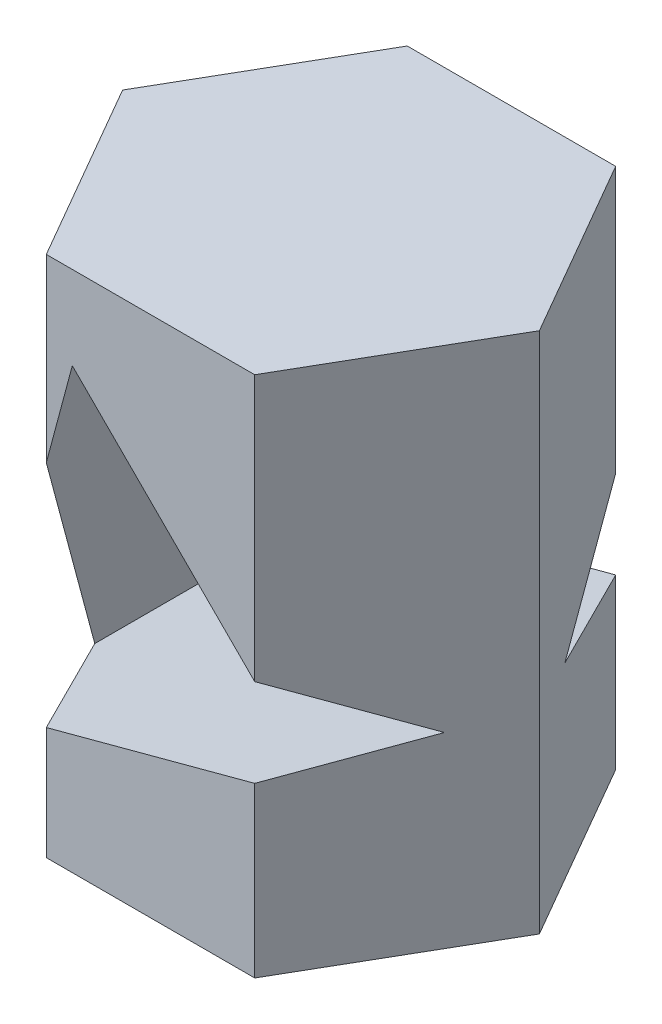
ISO-10303-21;
HEADER;
FILE_DESCRIPTION(('STEP AP214'),'2;1');
FILE_NAME('part.step','',(''),(''),'','','');
FILE_SCHEMA(('AUTOMOTIVE_DESIGN { 1 0 10303 214 1 1 1 1 }'));
ENDSEC;
DATA;
#1=APPLICATION_CONTEXT('core data for automotive mechanical design processes');
#2=APPLICATION_PROTOCOL_DEFINITION('international standard','automotive_design',2000,#1);
#3=PRODUCT_CONTEXT('',#1,'mechanical');
#4=PRODUCT('Part','Part','',(#3));
#5=PRODUCT_RELATED_PRODUCT_CATEGORY('part','',(#4));
#6=PRODUCT_DEFINITION_FORMATION('','',#4);
#7=PRODUCT_DEFINITION_CONTEXT('part definition',#1,'design');
#8=PRODUCT_DEFINITION('design','',#6,#7);
#9=PRODUCT_DEFINITION_SHAPE('','',#8);
#10=(LENGTH_UNIT() NAMED_UNIT(*) SI_UNIT(.MILLI.,.METRE.));
#11=(NAMED_UNIT(*) PLANE_ANGLE_UNIT() SI_UNIT($,.RADIAN.));
#12=(NAMED_UNIT(*) SI_UNIT($,.STERADIAN.) SOLID_ANGLE_UNIT());
#13=UNCERTAINTY_MEASURE_WITH_UNIT(LENGTH_MEASURE(1.E-05),#10,'distance_accuracy_value','');
#14=(GEOMETRIC_REPRESENTATION_CONTEXT(3) GLOBAL_UNCERTAINTY_ASSIGNED_CONTEXT((#13)) GLOBAL_UNIT_ASSIGNED_CONTEXT((#10,
#11,#12)) REPRESENTATION_CONTEXT('',''));
#15=CARTESIAN_POINT('',(0.,0.,0.));
#16=DIRECTION('',(0.,0.,1.));
#17=DIRECTION('',(1.,0.,0.));
#18=AXIS2_PLACEMENT_3D('',#15,#16,#17);
#19=CARTESIAN_POINT('',(21.9393102292057,110.,-38.));
#20=DIRECTION('',(0.,0.,1.));
#21=DIRECTION('',(1.,0.,0.));
#22=AXIS2_PLACEMENT_3D('',#19,#20,#21);
#23=PLANE('',#22);
#24=DIRECTION('',(0.,-1.,0.));
#25=VECTOR('',#24,1.);
#26=CARTESIAN_POINT('',(-21.9393102292058,110.,-38.));
#27=LINE('',#26,#25);
#28=CARTESIAN_POINT('',(-21.9393102292058,23.7350269189626,-38.));
#29=VERTEX_POINT('',#28);
#30=CARTESIAN_POINT('',(-21.9393102292058,0.,-38.));
#31=VERTEX_POINT('',#30);
#32=EDGE_CURVE('E222',#29,#31,#27,.T.);
#33=ORIENTED_EDGE('',*,*,#32,.F.);
#34=DIRECTION('',(0.965925826289068,0.258819045102521,0.));
#35=VECTOR('',#34,1.);
#36=CARTESIAN_POINT('',(-35.8786204584116,20.,-38.));
#37=LINE('',#36,#35);
#38=CARTESIAN_POINT('',(21.9393102292057,35.4922678357857,-38.));
#39=VERTEX_POINT('',#38);
#40=EDGE_CURVE('E146',#29,#39,#37,.T.);
#41=ORIENTED_EDGE('',*,*,#40,.T.);
#42=DIRECTION('',(0.,-1.,0.));
#43=VECTOR('',#42,1.);
#44=CARTESIAN_POINT('',(21.9393102292057,110.,-38.));
#45=LINE('',#44,#43);
#46=CARTESIAN_POINT('',(21.9393102292057,0.,-38.));
#47=VERTEX_POINT('',#46);
#48=EDGE_CURVE('E193',#39,#47,#45,.T.);
#49=ORIENTED_EDGE('',*,*,#48,.T.);
#50=DIRECTION('',(-1.,0.,0.));
#51=VECTOR('',#50,1.);
#52=CARTESIAN_POINT('',(21.9393102292057,0.,-38.));
#53=LINE('',#52,#51);
#54=EDGE_CURVE('E178',#47,#31,#53,.T.);
#55=ORIENTED_EDGE('',*,*,#54,.T.);
#56=EDGE_LOOP('',(#33,#41,#49,#55));
#57=FACE_BOUND('',#56,.T.);
#58=ADVANCED_FACE('F33',(#57),#23,.F.);
#59=CARTESIAN_POINT('',(-21.9393102292058,110.,38.));
#60=DIRECTION('',(0.,0.,-1.));
#61=DIRECTION('',(-1.,0.,0.));
#62=AXIS2_PLACEMENT_3D('',#59,#60,#61);
#63=PLANE('',#62);
#64=DIRECTION('',(0.,-1.,0.));
#65=VECTOR('',#64,1.);
#66=CARTESIAN_POINT('',(21.9393102292058,110.,38.));
#67=LINE('',#66,#65);
#68=CARTESIAN_POINT('',(21.9393102292058,35.4922678357857,38.));
#69=VERTEX_POINT('',#68);
#70=CARTESIAN_POINT('',(21.9393102292058,0.,38.));
#71=VERTEX_POINT('',#70);
#72=EDGE_CURVE('E214',#69,#71,#67,.T.);
#73=ORIENTED_EDGE('',*,*,#72,.F.);
#74=DIRECTION('',(0.965925826289068,0.258819045102521,0.));
#75=VECTOR('',#74,1.);
#76=CARTESIAN_POINT('',(-35.8786204584116,20.,38.));
#77=LINE('',#76,#75);
#78=CARTESIAN_POINT('',(-21.9393102292058,23.7350269189626,38.));
#79=VERTEX_POINT('',#78);
#80=EDGE_CURVE('E48',#79,#69,#77,.T.);
#81=ORIENTED_EDGE('',*,*,#80,.F.);
#82=DIRECTION('',(0.,-1.,0.));
#83=VECTOR('',#82,1.);
#84=CARTESIAN_POINT('',(-21.9393102292058,110.,38.));
#85=LINE('',#84,#83);
#86=CARTESIAN_POINT('',(-21.9393102292058,0.,38.));
#87=VERTEX_POINT('',#86);
#88=EDGE_CURVE('E217',#79,#87,#85,.T.);
#89=ORIENTED_EDGE('',*,*,#88,.T.);
#90=DIRECTION('',(1.,0.,0.));
#91=VECTOR('',#90,1.);
#92=CARTESIAN_POINT('',(-21.9393102292058,0.,38.));
#93=LINE('',#92,#91);
#94=EDGE_CURVE('E201',#87,#71,#93,.T.);
#95=ORIENTED_EDGE('',*,*,#94,.T.);
#96=EDGE_LOOP('',(#73,#81,#89,#95));
#97=FACE_BOUND('',#96,.T.);
#98=ADVANCED_FACE('F261',(#97),#63,.F.);
#99=CARTESIAN_POINT('',(21.9393102292057,110.,-38.));
#100=VERTEX_POINT('',#99);
#101=CARTESIAN_POINT('',(21.9393102292057,54.0379346667519,-38.));
#102=VERTEX_POINT('',#101);
#103=EDGE_CURVE('E208',#100,#102,#45,.T.);
#104=ORIENTED_EDGE('',*,*,#103,.T.);
#105=DIRECTION('',(-0.707106781186548,0.707106781186547,0.));
#106=VECTOR('',#105,1.);
#107=CARTESIAN_POINT('',(36.5658165132686,39.4114283826891,-38.));
#108=LINE('',#107,#106);
#109=CARTESIAN_POINT('',(-16.4671920757225,92.4444369716801,-38.));
#110=VERTEX_POINT('',#109);
#111=EDGE_CURVE('E154',#102,#110,#108,.T.);
#112=ORIENTED_EDGE('',*,*,#111,.T.);
#113=DIRECTION('',(-0.258819045102521,-0.965925826289068,0.));
#114=VECTOR('',#113,1.);
#115=CARTESIAN_POINT('',(-16.4671920757225,92.4444369716801,-38.));
#116=LINE('',#115,#114);
#117=CARTESIAN_POINT('',(-21.9393102292058,72.0222139978605,-38.));
#118=VERTEX_POINT('',#117);
#119=EDGE_CURVE('E143',#110,#118,#116,.T.);
#120=ORIENTED_EDGE('',*,*,#119,.T.);
#121=CARTESIAN_POINT('',(-21.9393102292058,110.,-38.));
#122=VERTEX_POINT('',#121);
#123=EDGE_CURVE('E223',#122,#118,#27,.T.);
#124=ORIENTED_EDGE('',*,*,#123,.F.);
#125=DIRECTION('',(-1.,0.,0.));
#126=VECTOR('',#125,1.);
#127=CARTESIAN_POINT('',(21.9393102292057,110.,-38.));
#128=LINE('',#127,#126);
#129=EDGE_CURVE('E179',#100,#122,#128,.T.);
#130=ORIENTED_EDGE('',*,*,#129,.F.);
#131=EDGE_LOOP('',(#104,#112,#120,#124,#130));
#132=FACE_BOUND('',#131,.T.);
#133=ADVANCED_FACE('F35',(#132),#23,.F.);
#134=CARTESIAN_POINT('',(-21.9393102292058,110.,-38.));
#135=DIRECTION('',(0.866025403784439,0.,0.5));
#136=DIRECTION('',(0.5,0.,-0.866025403784439));
#137=AXIS2_PLACEMENT_3D('',#134,#135,#136);
#138=PLANE('',#137);
#139=DIRECTION('',(-0.236173745241573,-0.881412416655379,0.409064926172233));
#140=VECTOR('',#139,1.);
#141=CARTESIAN_POINT('',(-14.0336085200901,101.526694445764,-51.6930770296725));
#142=LINE('',#141,#140);
#143=CARTESIAN_POINT('',(-35.8786204584116,20.,-13.856406460551));
#144=VERTEX_POINT('',#143);
#145=EDGE_CURVE('E175',#118,#144,#142,.T.);
#146=ORIENTED_EDGE('',*,*,#145,.T.);
#147=DIRECTION('',(0.495572219835078,0.132788176096108,-0.858356263574049));
#148=VECTOR('',#147,1.);
#149=CARTESIAN_POINT('',(-16.2625460930329,25.2561112848721,-47.8324439064363));
#150=LINE('',#149,#148);
#151=EDGE_CURVE('E169',#144,#29,#150,.T.);
#152=ORIENTED_EDGE('',*,*,#151,.T.);
#153=ORIENTED_EDGE('',*,*,#32,.T.);
#154=DIRECTION('',(-0.5,0.,0.866025403784439));
#155=VECTOR('',#154,1.);
#156=CARTESIAN_POINT('',(-21.9393102292058,0.,-38.));
#157=LINE('',#156,#155);
#158=CARTESIAN_POINT('',(-43.8786204584116,0.,0.));
#159=VERTEX_POINT('',#158);
#160=EDGE_CURVE('E196',#31,#159,#157,.T.);
#161=ORIENTED_EDGE('',*,*,#160,.T.);
#162=DIRECTION('',(0.,-1.,0.));
#163=VECTOR('',#162,1.);
#164=CARTESIAN_POINT('',(-43.8786204584116,110.,0.));
#165=LINE('',#164,#163);
#166=CARTESIAN_POINT('',(-43.8786204584116,110.,0.));
#167=VERTEX_POINT('',#166);
#168=EDGE_CURVE('E219',#167,#159,#165,.T.);
#169=ORIENTED_EDGE('',*,*,#168,.F.);
#170=DIRECTION('',(-0.5,0.,0.866025403784439));
#171=VECTOR('',#170,1.);
#172=CARTESIAN_POINT('',(-21.9393102292058,110.,-38.));
#173=LINE('',#172,#171);
#174=EDGE_CURVE('E182',#122,#167,#173,.T.);
#175=ORIENTED_EDGE('',*,*,#174,.F.);
#176=ORIENTED_EDGE('',*,*,#123,.T.);
#177=EDGE_LOOP('',(#146,#152,#153,#161,#169,#175,#176));
#178=FACE_BOUND('',#177,.T.);
#179=ADVANCED_FACE('F236',(#178),#138,.F.);
#180=CARTESIAN_POINT('',(-43.8786204584116,110.,0.));
#181=DIRECTION('',(0.866025403784439,0.,-0.5));
#182=DIRECTION('',(-0.5,0.,-0.866025403784439));
#183=AXIS2_PLACEMENT_3D('',#180,#181,#182);
#184=PLANE('',#183);
#185=ORIENTED_EDGE('',*,*,#88,.F.);
#186=DIRECTION('',(-0.495572219835078,-0.132788176096108,-0.858356263574049));
#187=VECTOR('',#186,1.);
#188=CARTESIAN_POINT('',(-37.8150070531021,19.4811467757182,10.5024864954516));
#189=LINE('',#188,#187);
#190=CARTESIAN_POINT('',(-35.8786204584116,20.,13.856406460551));
#191=VERTEX_POINT('',#190);
#192=EDGE_CURVE('E166',#79,#191,#189,.T.);
#193=ORIENTED_EDGE('',*,*,#192,.T.);
#194=DIRECTION('',(0.236173745241573,0.881412416655379,0.409064926172233));
#195=VECTOR('',#194,1.);
#196=CARTESIAN_POINT('',(-18.928535233584,83.2585792516791,43.2148152625749));
#197=LINE('',#196,#195);
#198=CARTESIAN_POINT('',(-21.9393102292058,72.0222139978606,38.));
#199=VERTEX_POINT('',#198);
#200=EDGE_CURVE('E173',#191,#199,#197,.T.);
#201=ORIENTED_EDGE('',*,*,#200,.T.);
#202=CARTESIAN_POINT('',(-21.9393102292058,110.,38.));
#203=VERTEX_POINT('',#202);
#204=EDGE_CURVE('E152',#203,#199,#85,.T.);
#205=ORIENTED_EDGE('',*,*,#204,.F.);
#206=DIRECTION('',(0.5,0.,0.866025403784439));
#207=VECTOR('',#206,1.);
#208=CARTESIAN_POINT('',(-43.8786204584116,110.,0.));
#209=LINE('',#208,#207);
#210=EDGE_CURVE('E185',#167,#203,#209,.T.);
#211=ORIENTED_EDGE('',*,*,#210,.F.);
#212=ORIENTED_EDGE('',*,*,#168,.T.);
#213=DIRECTION('',(0.5,0.,0.866025403784439));
#214=VECTOR('',#213,1.);
#215=CARTESIAN_POINT('',(-43.8786204584116,0.,0.));
#216=LINE('',#215,#214);
#217=EDGE_CURVE('E198',#159,#87,#216,.T.);
#218=ORIENTED_EDGE('',*,*,#217,.T.);
#219=EDGE_LOOP('',(#185,#193,#201,#205,#211,#212,#218));
#220=FACE_BOUND('',#219,.T.);
#221=ADVANCED_FACE('F246',(#220),#184,.F.);
#222=DIRECTION('',(-0.258819045102521,-0.965925826289068,0.));
#223=VECTOR('',#222,1.);
#224=CARTESIAN_POINT('',(-16.4671920757225,92.4444369716801,38.));
#225=LINE('',#224,#223);
#226=CARTESIAN_POINT('',(-16.4671920757225,92.4444369716801,38.));
#227=VERTEX_POINT('',#226);
#228=EDGE_CURVE('E137',#227,#199,#225,.T.);
#229=ORIENTED_EDGE('',*,*,#228,.F.);
#230=DIRECTION('',(-0.707106781186548,0.707106781186547,0.));
#231=VECTOR('',#230,1.);
#232=CARTESIAN_POINT('',(36.5658165132686,39.4114283826891,38.));
#233=LINE('',#232,#231);
#234=CARTESIAN_POINT('',(21.9393102292058,54.0379346667519,38.));
#235=VERTEX_POINT('',#234);
#236=EDGE_CURVE('E126',#235,#227,#233,.T.);
#237=ORIENTED_EDGE('',*,*,#236,.F.);
#238=CARTESIAN_POINT('',(21.9393102292058,110.,38.));
#239=VERTEX_POINT('',#238);
#240=EDGE_CURVE('E215',#239,#235,#67,.T.);
#241=ORIENTED_EDGE('',*,*,#240,.F.);
#242=DIRECTION('',(1.,0.,0.));
#243=VECTOR('',#242,1.);
#244=CARTESIAN_POINT('',(-21.9393102292058,110.,38.));
#245=LINE('',#244,#243);
#246=EDGE_CURVE('E187',#203,#239,#245,.T.);
#247=ORIENTED_EDGE('',*,*,#246,.F.);
#248=ORIENTED_EDGE('',*,*,#204,.T.);
#249=EDGE_LOOP('',(#229,#237,#241,#247,#248));
#250=FACE_BOUND('',#249,.T.);
#251=ADVANCED_FACE('F149',(#250),#63,.F.);
#252=CARTESIAN_POINT('',(21.9393102292058,110.,38.));
#253=DIRECTION('',(-0.866025403784439,0.,-0.5));
#254=DIRECTION('',(-0.5,0.,0.866025403784439));
#255=AXIS2_PLACEMENT_3D('',#252,#253,#254);
#256=PLANE('',#255);
#257=ORIENTED_EDGE('',*,*,#240,.T.);
#258=DIRECTION('',(0.447213595499958,-0.447213595499958,-0.774596669241484));
#259=VECTOR('',#258,1.);
#260=CARTESIAN_POINT('',(10.7468971625562,65.2303477334015,57.3858280907349));
#261=LINE('',#260,#259);
#262=CARTESIAN_POINT('',(36.5658165132686,39.4114283826891,12.6661479787778));
#263=VERTEX_POINT('',#262);
#264=EDGE_CURVE('E132',#235,#263,#261,.T.);
#265=ORIENTED_EDGE('',*,*,#264,.T.);
#266=DIRECTION('',(-0.495572219835078,-0.132788176096108,0.858356263574049));
#267=VECTOR('',#266,1.);
#268=CARTESIAN_POINT('',(26.8423758271056,36.8060403031798,29.5076412715945));
#269=LINE('',#268,#267);
#270=EDGE_CURVE('E162',#263,#69,#269,.T.);
#271=ORIENTED_EDGE('',*,*,#270,.T.);
#272=ORIENTED_EDGE('',*,*,#72,.T.);
#273=DIRECTION('',(0.5,0.,-0.866025403784439));
#274=VECTOR('',#273,1.);
#275=CARTESIAN_POINT('',(21.9393102292058,0.,38.));
#276=LINE('',#275,#274);
#277=CARTESIAN_POINT('',(43.8786204584116,0.,0.));
#278=VERTEX_POINT('',#277);
#279=EDGE_CURVE('E204',#71,#278,#276,.T.);
#280=ORIENTED_EDGE('',*,*,#279,.T.);
#281=DIRECTION('',(0.,-1.,0.));
#282=VECTOR('',#281,1.);
#283=CARTESIAN_POINT('',(43.8786204584116,110.,0.));
#284=LINE('',#283,#282);
#285=CARTESIAN_POINT('',(43.8786204584116,110.,0.));
#286=VERTEX_POINT('',#285);
#287=EDGE_CURVE('E211',#286,#278,#284,.T.);
#288=ORIENTED_EDGE('',*,*,#287,.F.);
#289=DIRECTION('',(0.5,0.,-0.866025403784439));
#290=VECTOR('',#289,1.);
#291=CARTESIAN_POINT('',(21.9393102292058,110.,38.));
#292=LINE('',#291,#290);
#293=EDGE_CURVE('E189',#239,#286,#292,.T.);
#294=ORIENTED_EDGE('',*,*,#293,.F.);
#295=EDGE_LOOP('',(#257,#265,#271,#272,#280,#288,#294));
#296=FACE_BOUND('',#295,.T.);
#297=ADVANCED_FACE('F255',(#296),#256,.F.);
#298=CARTESIAN_POINT('',(43.8786204584116,110.,0.));
#299=DIRECTION('',(-0.866025403784439,0.,0.5));
#300=DIRECTION('',(0.5,0.,0.866025403784439));
#301=AXIS2_PLACEMENT_3D('',#298,#299,#300);
#302=PLANE('',#301);
#303=DIRECTION('',(0.495572219835079,0.132788176096108,0.858356263574048));
#304=VECTOR('',#303,1.);
#305=CARTESIAN_POINT('',(48.3948367871748,42.5810048123337,7.82231613939015));
#306=LINE('',#305,#304);
#307=CARTESIAN_POINT('',(36.5658165132686,39.4114283826891,-12.6661479787777));
#308=VERTEX_POINT('',#307);
#309=EDGE_CURVE('E41',#39,#308,#306,.T.);
#310=ORIENTED_EDGE('',*,*,#309,.T.);
#311=DIRECTION('',(-0.447213595499958,0.447213595499958,-0.774596669241483));
#312=VECTOR('',#311,1.);
#313=CARTESIAN_POINT('',(28.2983453459208,47.6788995500369,-26.9858280907349));
#314=LINE('',#313,#312);
#315=EDGE_CURVE('E11',#308,#102,#314,.T.);
#316=ORIENTED_EDGE('',*,*,#315,.T.);
#317=ORIENTED_EDGE('',*,*,#103,.F.);
#318=DIRECTION('',(-0.5,0.,-0.866025403784438));
#319=VECTOR('',#318,1.);
#320=CARTESIAN_POINT('',(43.8786204584116,110.,0.));
#321=LINE('',#320,#319);
#322=EDGE_CURVE('E191',#286,#100,#321,.T.);
#323=ORIENTED_EDGE('',*,*,#322,.F.);
#324=ORIENTED_EDGE('',*,*,#287,.T.);
#325=DIRECTION('',(-0.5,0.,-0.866025403784438));
#326=VECTOR('',#325,1.);
#327=CARTESIAN_POINT('',(43.8786204584116,0.,0.));
#328=LINE('',#327,#326);
#329=EDGE_CURVE('E183',#278,#47,#328,.T.);
#330=ORIENTED_EDGE('',*,*,#329,.T.);
#331=ORIENTED_EDGE('',*,*,#48,.F.);
#332=EDGE_LOOP('',(#310,#316,#317,#323,#324,#330,#331));
#333=FACE_BOUND('',#332,.T.);
#334=ADVANCED_FACE('F228',(#333),#302,.F.);
#335=CARTESIAN_POINT('',(0.,110.,0.));
#336=DIRECTION('',(0.,1.,0.));
#337=DIRECTION('',(0.,0.,1.));
#338=AXIS2_PLACEMENT_3D('',#335,#336,#337);
#339=PLANE('',#338);
#340=ORIENTED_EDGE('',*,*,#129,.T.);
#341=ORIENTED_EDGE('',*,*,#174,.T.);
#342=ORIENTED_EDGE('',*,*,#210,.T.);
#343=ORIENTED_EDGE('',*,*,#246,.T.);
#344=ORIENTED_EDGE('',*,*,#293,.T.);
#345=ORIENTED_EDGE('',*,*,#322,.T.);
#346=EDGE_LOOP('',(#340,#341,#342,#343,#344,#345));
#347=FACE_BOUND('',#346,.T.);
#348=ADVANCED_FACE('F251',(#347),#339,.T.);
#349=CARTESIAN_POINT('',(0.,0.,0.));
#350=DIRECTION('',(0.,1.,0.));
#351=DIRECTION('',(0.,0.,1.));
#352=AXIS2_PLACEMENT_3D('',#349,#350,#351);
#353=PLANE('',#352);
#354=ORIENTED_EDGE('',*,*,#54,.F.);
#355=ORIENTED_EDGE('',*,*,#329,.F.);
#356=ORIENTED_EDGE('',*,*,#279,.F.);
#357=ORIENTED_EDGE('',*,*,#94,.F.);
#358=ORIENTED_EDGE('',*,*,#217,.F.);
#359=ORIENTED_EDGE('',*,*,#160,.F.);
#360=EDGE_LOOP('',(#354,#355,#356,#357,#358,#359));
#361=FACE_BOUND('',#360,.T.);
#362=ADVANCED_FACE('F240',(#361),#353,.F.);
#363=CARTESIAN_POINT('',(-16.4671920757225,92.4444369716801,-38.));
#364=DIRECTION('',(-0.965925826289068,0.258819045102521,0.));
#365=DIRECTION('',(-0.258819045102521,-0.965925826289068,0.));
#366=AXIS2_PLACEMENT_3D('',#363,#364,#365);
#367=PLANE('',#366);
#368=ORIENTED_EDGE('',*,*,#119,.F.);
#369=DIRECTION('',(0.,0.,1.));
#370=VECTOR('',#369,1.);
#371=CARTESIAN_POINT('',(-16.4671920757225,92.4444369716801,-38.));
#372=LINE('',#371,#370);
#373=EDGE_CURVE('E129',#110,#227,#372,.T.);
#374=ORIENTED_EDGE('',*,*,#373,.T.);
#375=ORIENTED_EDGE('',*,*,#228,.T.);
#376=ORIENTED_EDGE('',*,*,#200,.F.);
#377=DIRECTION('',(0.,0.,1.));
#378=VECTOR('',#377,1.);
#379=CARTESIAN_POINT('',(-35.8786204584116,20.,-38.));
#380=LINE('',#379,#378);
#381=EDGE_CURVE('E145',#144,#191,#380,.T.);
#382=ORIENTED_EDGE('',*,*,#381,.F.);
#383=ORIENTED_EDGE('',*,*,#145,.F.);
#384=EDGE_LOOP('',(#368,#374,#375,#376,#382,#383));
#385=FACE_BOUND('',#384,.T.);
#386=ADVANCED_FACE('F140',(#385),#367,.F.);
#387=CARTESIAN_POINT('',(36.5658165132686,39.4114283826891,-38.));
#388=DIRECTION('',(0.707106781186547,0.707106781186548,0.));
#389=DIRECTION('',(-0.707106781186548,0.707106781186547,0.));
#390=AXIS2_PLACEMENT_3D('',#387,#388,#389);
#391=PLANE('',#390);
#392=ORIENTED_EDGE('',*,*,#236,.T.);
#393=ORIENTED_EDGE('',*,*,#373,.F.);
#394=ORIENTED_EDGE('',*,*,#111,.F.);
#395=ORIENTED_EDGE('',*,*,#315,.F.);
#396=DIRECTION('',(0.,0.,1.));
#397=VECTOR('',#396,1.);
#398=CARTESIAN_POINT('',(36.5658165132686,39.4114283826891,-38.));
#399=LINE('',#398,#397);
#400=EDGE_CURVE('E54',#308,#263,#399,.T.);
#401=ORIENTED_EDGE('',*,*,#400,.T.);
#402=ORIENTED_EDGE('',*,*,#264,.F.);
#403=EDGE_LOOP('',(#392,#393,#394,#395,#401,#402));
#404=FACE_BOUND('',#403,.T.);
#405=ADVANCED_FACE('F128',(#404),#391,.F.);
#406=CARTESIAN_POINT('',(-35.8786204584116,20.,-38.));
#407=DIRECTION('',(0.258819045102521,-0.965925826289068,0.));
#408=DIRECTION('',(0.965925826289068,0.258819045102521,0.));
#409=AXIS2_PLACEMENT_3D('',#406,#407,#408);
#410=PLANE('',#409);
#411=ORIENTED_EDGE('',*,*,#381,.T.);
#412=ORIENTED_EDGE('',*,*,#192,.F.);
#413=ORIENTED_EDGE('',*,*,#80,.T.);
#414=ORIENTED_EDGE('',*,*,#270,.F.);
#415=ORIENTED_EDGE('',*,*,#400,.F.);
#416=ORIENTED_EDGE('',*,*,#309,.F.);
#417=ORIENTED_EDGE('',*,*,#40,.F.);
#418=ORIENTED_EDGE('',*,*,#151,.F.);
#419=EDGE_LOOP('',(#411,#412,#413,#414,#415,#416,#417,#418));
#420=FACE_BOUND('',#419,.T.);
#421=ADVANCED_FACE('F230',(#420),#410,.F.);
#422=CLOSED_SHELL('',(#58,#98,#133,#179,#221,#251,#297,#334,#348,#362,#386,#405,#421));
#423=MANIFOLD_SOLID_BREP('B2',#422);
#424=ADVANCED_BREP_SHAPE_REPRESENTATION('',(#18,#423),#14);
#425=SHAPE_DEFINITION_REPRESENTATION(#9,#424);
ENDSEC;
END-ISO-10303-21;
